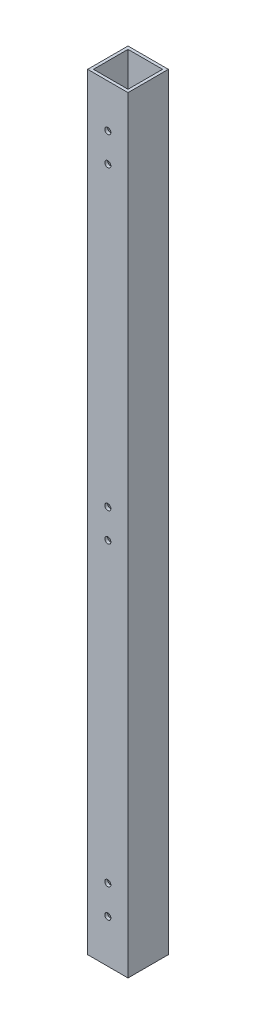
ISO-10303-21;
HEADER;
FILE_DESCRIPTION(('STEP AP214'),'2;1');
FILE_NAME('part.step','',(''),(''),'','','');
FILE_SCHEMA(('AUTOMOTIVE_DESIGN { 1 0 10303 214 1 1 1 1 }'));
ENDSEC;
DATA;
#1=APPLICATION_CONTEXT('core data for automotive mechanical design processes');
#2=APPLICATION_PROTOCOL_DEFINITION('international standard','automotive_design',2000,#1);
#3=PRODUCT_CONTEXT('',#1,'mechanical');
#4=PRODUCT('Part','Part','',(#3));
#5=PRODUCT_RELATED_PRODUCT_CATEGORY('part','',(#4));
#6=PRODUCT_DEFINITION_FORMATION('','',#4);
#7=PRODUCT_DEFINITION_CONTEXT('part definition',#1,'design');
#8=PRODUCT_DEFINITION('design','',#6,#7);
#9=PRODUCT_DEFINITION_SHAPE('','',#8);
#10=(LENGTH_UNIT() NAMED_UNIT(*) SI_UNIT(.MILLI.,.METRE.));
#11=(NAMED_UNIT(*) PLANE_ANGLE_UNIT() SI_UNIT($,.RADIAN.));
#12=(NAMED_UNIT(*) SI_UNIT($,.STERADIAN.) SOLID_ANGLE_UNIT());
#13=UNCERTAINTY_MEASURE_WITH_UNIT(LENGTH_MEASURE(1.E-05),#10,'distance_accuracy_value','');
#14=(GEOMETRIC_REPRESENTATION_CONTEXT(3) GLOBAL_UNCERTAINTY_ASSIGNED_CONTEXT((#13)) GLOBAL_UNIT_ASSIGNED_CONTEXT((#10,
#11,#12)) REPRESENTATION_CONTEXT('',''));
#15=CARTESIAN_POINT('',(0.,0.,0.));
#16=DIRECTION('',(0.,0.,1.));
#17=DIRECTION('',(1.,0.,0.));
#18=AXIS2_PLACEMENT_3D('',#15,#16,#17);
#19=CARTESIAN_POINT('',(0.,844.55,0.));
#20=DIRECTION('',(0.,-1.,0.));
#21=DIRECTION('',(0.,0.,-1.));
#22=AXIS2_PLACEMENT_3D('',#19,#20,#21);
#23=PLANE('',#22);
#24=DIRECTION('',(0.,0.,1.));
#25=VECTOR('',#24,1.);
#26=CARTESIAN_POINT('',(0.,844.55,0.));
#27=LINE('',#26,#25);
#28=CARTESIAN_POINT('',(0.,844.55,-44.45));
#29=VERTEX_POINT('',#28);
#30=CARTESIAN_POINT('',(0.,844.55,0.));
#31=VERTEX_POINT('',#30);
#32=EDGE_CURVE('E139',#29,#31,#27,.T.);
#33=ORIENTED_EDGE('',*,*,#32,.T.);
#34=DIRECTION('',(1.,0.,0.));
#35=VECTOR('',#34,1.);
#36=CARTESIAN_POINT('',(0.,844.55,0.));
#37=LINE('',#36,#35);
#38=CARTESIAN_POINT('',(44.45,844.55,0.));
#39=VERTEX_POINT('',#38);
#40=EDGE_CURVE('E142',#31,#39,#37,.T.);
#41=ORIENTED_EDGE('',*,*,#40,.T.);
#42=DIRECTION('',(0.,0.,-1.));
#43=VECTOR('',#42,1.);
#44=CARTESIAN_POINT('',(44.45,844.55,0.));
#45=LINE('',#44,#43);
#46=CARTESIAN_POINT('',(44.45,844.55,-44.45));
#47=VERTEX_POINT('',#46);
#48=EDGE_CURVE('E145',#39,#47,#45,.T.);
#49=ORIENTED_EDGE('',*,*,#48,.T.);
#50=DIRECTION('',(-1.,0.,0.));
#51=VECTOR('',#50,1.);
#52=CARTESIAN_POINT('',(0.,844.55,-44.45));
#53=LINE('',#52,#51);
#54=EDGE_CURVE('E147',#47,#29,#53,.T.);
#55=ORIENTED_EDGE('',*,*,#54,.T.);
#56=EDGE_LOOP('',(#33,#41,#49,#55));
#57=FACE_BOUND('',#56,.T.);
#58=DIRECTION('',(0.,0.,1.));
#59=VECTOR('',#58,1.);
#60=CARTESIAN_POINT('',(3.175,844.55,-41.275));
#61=LINE('',#60,#59);
#62=CARTESIAN_POINT('',(3.175,844.55,-41.275));
#63=VERTEX_POINT('',#62);
#64=CARTESIAN_POINT('',(3.17500000000001,844.55,-3.175));
#65=VERTEX_POINT('',#64);
#66=EDGE_CURVE('E101',#63,#65,#61,.T.);
#67=ORIENTED_EDGE('',*,*,#66,.F.);
#68=DIRECTION('',(-1.,0.,0.));
#69=VECTOR('',#68,1.);
#70=CARTESIAN_POINT('',(3.175,844.55,-41.275));
#71=LINE('',#70,#69);
#72=CARTESIAN_POINT('',(41.275,844.55,-41.275));
#73=VERTEX_POINT('',#72);
#74=EDGE_CURVE('E123',#73,#63,#71,.T.);
#75=ORIENTED_EDGE('',*,*,#74,.F.);
#76=DIRECTION('',(0.,0.,-1.));
#77=VECTOR('',#76,1.);
#78=CARTESIAN_POINT('',(41.275,844.55,-41.275));
#79=LINE('',#78,#77);
#80=CARTESIAN_POINT('',(41.275,844.55,-3.175));
#81=VERTEX_POINT('',#80);
#82=EDGE_CURVE('E121',#81,#73,#79,.T.);
#83=ORIENTED_EDGE('',*,*,#82,.F.);
#84=DIRECTION('',(1.,0.,0.));
#85=VECTOR('',#84,1.);
#86=CARTESIAN_POINT('',(3.17500000000001,844.55,-3.175));
#87=LINE('',#86,#85);
#88=EDGE_CURVE('E109',#65,#81,#87,.T.);
#89=ORIENTED_EDGE('',*,*,#88,.F.);
#90=EDGE_LOOP('',(#67,#75,#83,#89));
#91=FACE_BOUND('',#90,.T.);
#92=ADVANCED_FACE('F34',(#57,#91),#23,.F.);
#93=CARTESIAN_POINT('',(0.,0.,0.));
#94=DIRECTION('',(0.,-1.,0.));
#95=DIRECTION('',(0.,0.,-1.));
#96=AXIS2_PLACEMENT_3D('',#93,#94,#95);
#97=PLANE('',#96);
#98=DIRECTION('',(0.,0.,1.));
#99=VECTOR('',#98,1.);
#100=CARTESIAN_POINT('',(0.,0.,0.));
#101=LINE('',#100,#99);
#102=CARTESIAN_POINT('',(0.,0.,-44.45));
#103=VERTEX_POINT('',#102);
#104=CARTESIAN_POINT('',(0.,0.,0.));
#105=VERTEX_POINT('',#104);
#106=EDGE_CURVE('E117',#103,#105,#101,.T.);
#107=ORIENTED_EDGE('',*,*,#106,.F.);
#108=DIRECTION('',(-1.,0.,0.));
#109=VECTOR('',#108,1.);
#110=CARTESIAN_POINT('',(0.,0.,-44.45));
#111=LINE('',#110,#109);
#112=CARTESIAN_POINT('',(44.45,0.,-44.45));
#113=VERTEX_POINT('',#112);
#114=EDGE_CURVE('E143',#113,#103,#111,.T.);
#115=ORIENTED_EDGE('',*,*,#114,.F.);
#116=DIRECTION('',(0.,0.,-1.));
#117=VECTOR('',#116,1.);
#118=CARTESIAN_POINT('',(44.45,0.,0.));
#119=LINE('',#118,#117);
#120=CARTESIAN_POINT('',(44.45,0.,0.));
#121=VERTEX_POINT('',#120);
#122=EDGE_CURVE('E154',#121,#113,#119,.T.);
#123=ORIENTED_EDGE('',*,*,#122,.F.);
#124=DIRECTION('',(1.,0.,0.));
#125=VECTOR('',#124,1.);
#126=CARTESIAN_POINT('',(0.,0.,0.));
#127=LINE('',#126,#125);
#128=EDGE_CURVE('E152',#105,#121,#127,.T.);
#129=ORIENTED_EDGE('',*,*,#128,.F.);
#130=EDGE_LOOP('',(#107,#115,#123,#129));
#131=FACE_BOUND('',#130,.T.);
#132=DIRECTION('',(-1.,0.,0.));
#133=VECTOR('',#132,1.);
#134=CARTESIAN_POINT('',(3.175,0.,-41.275));
#135=LINE('',#134,#133);
#136=CARTESIAN_POINT('',(41.275,0.,-41.275));
#137=VERTEX_POINT('',#136);
#138=CARTESIAN_POINT('',(3.175,0.,-41.275));
#139=VERTEX_POINT('',#138);
#140=EDGE_CURVE('E110',#137,#139,#135,.T.);
#141=ORIENTED_EDGE('',*,*,#140,.T.);
#142=DIRECTION('',(0.,0.,1.));
#143=VECTOR('',#142,1.);
#144=CARTESIAN_POINT('',(3.175,0.,-41.275));
#145=LINE('',#144,#143);
#146=CARTESIAN_POINT('',(3.17500000000001,0.,-3.175));
#147=VERTEX_POINT('',#146);
#148=EDGE_CURVE('E59',#139,#147,#145,.T.);
#149=ORIENTED_EDGE('',*,*,#148,.T.);
#150=DIRECTION('',(1.,0.,0.));
#151=VECTOR('',#150,1.);
#152=CARTESIAN_POINT('',(3.17500000000001,0.,-3.175));
#153=LINE('',#152,#151);
#154=CARTESIAN_POINT('',(41.275,0.,-3.175));
#155=VERTEX_POINT('',#154);
#156=EDGE_CURVE('E116',#147,#155,#153,.T.);
#157=ORIENTED_EDGE('',*,*,#156,.T.);
#158=DIRECTION('',(0.,0.,-1.));
#159=VECTOR('',#158,1.);
#160=CARTESIAN_POINT('',(41.275,0.,-41.275));
#161=LINE('',#160,#159);
#162=EDGE_CURVE('E131',#155,#137,#161,.T.);
#163=ORIENTED_EDGE('',*,*,#162,.T.);
#164=EDGE_LOOP('',(#141,#149,#157,#163));
#165=FACE_BOUND('',#164,.T.);
#166=ADVANCED_FACE('F238',(#131,#165),#97,.T.);
#167=CARTESIAN_POINT('',(0.,844.55,0.));
#168=DIRECTION('',(1.,0.,0.));
#169=DIRECTION('',(0.,0.,-1.));
#170=AXIS2_PLACEMENT_3D('',#167,#168,#169);
#171=PLANE('',#170);
#172=ORIENTED_EDGE('',*,*,#106,.T.);
#173=DIRECTION('',(0.,-1.,0.));
#174=VECTOR('',#173,1.);
#175=CARTESIAN_POINT('',(0.,844.55,0.));
#176=LINE('',#175,#174);
#177=EDGE_CURVE('E11',#31,#105,#176,.T.);
#178=ORIENTED_EDGE('',*,*,#177,.F.);
#179=ORIENTED_EDGE('',*,*,#32,.F.);
#180=DIRECTION('',(0.,-1.,0.));
#181=VECTOR('',#180,1.);
#182=CARTESIAN_POINT('',(0.,844.55,-44.45));
#183=LINE('',#182,#181);
#184=EDGE_CURVE('E149',#29,#103,#183,.T.);
#185=ORIENTED_EDGE('',*,*,#184,.T.);
#186=EDGE_LOOP('',(#172,#178,#179,#185));
#187=FACE_BOUND('',#186,.T.);
#188=ADVANCED_FACE('F36',(#187),#171,.F.);
#189=CARTESIAN_POINT('',(0.,844.55,0.));
#190=DIRECTION('',(0.,0.,-1.));
#191=DIRECTION('',(-1.,0.,0.));
#192=AXIS2_PLACEMENT_3D('',#189,#190,#191);
#193=PLANE('',#192);
#194=CARTESIAN_POINT('',(22.225,796.925,0.));
#195=DIRECTION('',(0.,0.,1.));
#196=DIRECTION('',(1.,0.,0.));
#197=AXIS2_PLACEMENT_3D('',#194,#195,#196);
#198=CIRCLE('',#197,3.37350099999999);
#199=CARTESIAN_POINT('',(25.598501,796.925,0.));
#200=VERTEX_POINT('',#199);
#201=EDGE_CURVE('E274',#200,#200,#198,.T.);
#202=ORIENTED_EDGE('',*,*,#201,.F.);
#203=EDGE_LOOP('',(#202));
#204=FACE_BOUND('',#203,.T.);
#205=CARTESIAN_POINT('',(22.225,765.175,0.));
#206=DIRECTION('',(0.,0.,1.));
#207=DIRECTION('',(1.,0.,0.));
#208=AXIS2_PLACEMENT_3D('',#205,#206,#207);
#209=CIRCLE('',#208,3.37350099999999);
#210=CARTESIAN_POINT('',(25.598501,765.175,0.));
#211=VERTEX_POINT('',#210);
#212=EDGE_CURVE('E188',#211,#211,#209,.T.);
#213=ORIENTED_EDGE('',*,*,#212,.F.);
#214=EDGE_LOOP('',(#213));
#215=FACE_BOUND('',#214,.T.);
#216=CARTESIAN_POINT('',(22.225,438.15,0.));
#217=DIRECTION('',(0.,0.,1.));
#218=DIRECTION('',(1.,0.,0.));
#219=AXIS2_PLACEMENT_3D('',#216,#217,#218);
#220=CIRCLE('',#219,3.37350099999999);
#221=CARTESIAN_POINT('',(25.598501,438.15,0.));
#222=VERTEX_POINT('',#221);
#223=EDGE_CURVE('E185',#222,#222,#220,.T.);
#224=ORIENTED_EDGE('',*,*,#223,.F.);
#225=EDGE_LOOP('',(#224));
#226=FACE_BOUND('',#225,.T.);
#227=CARTESIAN_POINT('',(22.225,406.4,0.));
#228=DIRECTION('',(0.,0.,1.));
#229=DIRECTION('',(1.,0.,0.));
#230=AXIS2_PLACEMENT_3D('',#227,#228,#229);
#231=CIRCLE('',#230,3.37350099999999);
#232=CARTESIAN_POINT('',(25.598501,406.4,0.));
#233=VERTEX_POINT('',#232);
#234=EDGE_CURVE('E203',#233,#233,#231,.T.);
#235=ORIENTED_EDGE('',*,*,#234,.F.);
#236=EDGE_LOOP('',(#235));
#237=FACE_BOUND('',#236,.T.);
#238=CARTESIAN_POINT('',(22.225,79.3750000000001,0.));
#239=DIRECTION('',(0.,0.,1.));
#240=DIRECTION('',(1.,0.,0.));
#241=AXIS2_PLACEMENT_3D('',#238,#239,#240);
#242=CIRCLE('',#241,3.37350099999999);
#243=CARTESIAN_POINT('',(25.598501,79.3750000000001,0.));
#244=VERTEX_POINT('',#243);
#245=EDGE_CURVE('E210',#244,#244,#242,.T.);
#246=ORIENTED_EDGE('',*,*,#245,.F.);
#247=EDGE_LOOP('',(#246));
#248=FACE_BOUND('',#247,.T.);
#249=CARTESIAN_POINT('',(22.225,47.625,0.));
#250=DIRECTION('',(0.,0.,1.));
#251=DIRECTION('',(1.,0.,0.));
#252=AXIS2_PLACEMENT_3D('',#249,#250,#251);
#253=CIRCLE('',#252,3.37350099999999);
#254=CARTESIAN_POINT('',(25.598501,47.625,0.));
#255=VERTEX_POINT('',#254);
#256=EDGE_CURVE('E217',#255,#255,#253,.T.);
#257=ORIENTED_EDGE('',*,*,#256,.F.);
#258=EDGE_LOOP('',(#257));
#259=FACE_BOUND('',#258,.T.);
#260=ORIENTED_EDGE('',*,*,#128,.T.);
#261=DIRECTION('',(0.,-1.,0.));
#262=VECTOR('',#261,1.);
#263=CARTESIAN_POINT('',(44.45,844.55,0.));
#264=LINE('',#263,#262);
#265=EDGE_CURVE('E43',#39,#121,#264,.T.);
#266=ORIENTED_EDGE('',*,*,#265,.F.);
#267=ORIENTED_EDGE('',*,*,#40,.F.);
#268=ORIENTED_EDGE('',*,*,#177,.T.);
#269=EDGE_LOOP('',(#260,#266,#267,#268));
#270=FACE_BOUND('',#269,.T.);
#271=ADVANCED_FACE('F263',(#204,#215,#226,#237,#248,#259,#270),#193,.F.);
#272=CARTESIAN_POINT('',(44.45,844.55,0.));
#273=DIRECTION('',(-1.,0.,0.));
#274=DIRECTION('',(0.,0.,1.));
#275=AXIS2_PLACEMENT_3D('',#272,#273,#274);
#276=PLANE('',#275);
#277=ORIENTED_EDGE('',*,*,#122,.T.);
#278=DIRECTION('',(0.,-1.,0.));
#279=VECTOR('',#278,1.);
#280=CARTESIAN_POINT('',(44.45,844.55,-44.45));
#281=LINE('',#280,#279);
#282=EDGE_CURVE('E159',#47,#113,#281,.T.);
#283=ORIENTED_EDGE('',*,*,#282,.F.);
#284=ORIENTED_EDGE('',*,*,#48,.F.);
#285=ORIENTED_EDGE('',*,*,#265,.T.);
#286=EDGE_LOOP('',(#277,#283,#284,#285));
#287=FACE_BOUND('',#286,.T.);
#288=ADVANCED_FACE('F260',(#287),#276,.F.);
#289=CARTESIAN_POINT('',(0.,844.55,-44.45));
#290=DIRECTION('',(0.,0.,1.));
#291=DIRECTION('',(1.,0.,0.));
#292=AXIS2_PLACEMENT_3D('',#289,#290,#291);
#293=PLANE('',#292);
#294=CARTESIAN_POINT('',(22.225,796.925,-44.45));
#295=DIRECTION('',(0.,0.,1.));
#296=DIRECTION('',(1.,0.,0.));
#297=AXIS2_PLACEMENT_3D('',#294,#295,#296);
#298=CIRCLE('',#297,3.37350099999999);
#299=CARTESIAN_POINT('',(25.598501,796.925,-44.45));
#300=VERTEX_POINT('',#299);
#301=EDGE_CURVE('E339',#300,#300,#298,.T.);
#302=ORIENTED_EDGE('',*,*,#301,.T.);
#303=EDGE_LOOP('',(#302));
#304=FACE_BOUND('',#303,.T.);
#305=CARTESIAN_POINT('',(22.225,765.175,-44.45));
#306=DIRECTION('',(0.,0.,1.));
#307=DIRECTION('',(1.,0.,0.));
#308=AXIS2_PLACEMENT_3D('',#305,#306,#307);
#309=CIRCLE('',#308,3.37350099999999);
#310=CARTESIAN_POINT('',(25.598501,765.175,-44.45));
#311=VERTEX_POINT('',#310);
#312=EDGE_CURVE('E181',#311,#311,#309,.T.);
#313=ORIENTED_EDGE('',*,*,#312,.T.);
#314=EDGE_LOOP('',(#313));
#315=FACE_BOUND('',#314,.T.);
#316=CARTESIAN_POINT('',(22.225,438.15,-44.45));
#317=DIRECTION('',(0.,0.,1.));
#318=DIRECTION('',(1.,0.,0.));
#319=AXIS2_PLACEMENT_3D('',#316,#317,#318);
#320=CIRCLE('',#319,3.37350099999999);
#321=CARTESIAN_POINT('',(25.598501,438.15,-44.45));
#322=VERTEX_POINT('',#321);
#323=EDGE_CURVE('E177',#322,#322,#320,.T.);
#324=ORIENTED_EDGE('',*,*,#323,.T.);
#325=EDGE_LOOP('',(#324));
#326=FACE_BOUND('',#325,.T.);
#327=CARTESIAN_POINT('',(22.225,406.4,-44.45));
#328=DIRECTION('',(0.,0.,1.));
#329=DIRECTION('',(1.,0.,0.));
#330=AXIS2_PLACEMENT_3D('',#327,#328,#329);
#331=CIRCLE('',#330,3.37350099999999);
#332=CARTESIAN_POINT('',(25.598501,406.4,-44.45));
#333=VERTEX_POINT('',#332);
#334=EDGE_CURVE('E173',#333,#333,#331,.T.);
#335=ORIENTED_EDGE('',*,*,#334,.T.);
#336=EDGE_LOOP('',(#335));
#337=FACE_BOUND('',#336,.T.);
#338=CARTESIAN_POINT('',(22.225,79.3750000000001,-44.45));
#339=DIRECTION('',(0.,0.,1.));
#340=DIRECTION('',(1.,0.,0.));
#341=AXIS2_PLACEMENT_3D('',#338,#339,#340);
#342=CIRCLE('',#341,3.37350099999999);
#343=CARTESIAN_POINT('',(25.598501,79.3750000000001,-44.45));
#344=VERTEX_POINT('',#343);
#345=EDGE_CURVE('E168',#344,#344,#342,.T.);
#346=ORIENTED_EDGE('',*,*,#345,.T.);
#347=EDGE_LOOP('',(#346));
#348=FACE_BOUND('',#347,.T.);
#349=CARTESIAN_POINT('',(22.225,47.625,-44.45));
#350=DIRECTION('',(0.,0.,1.));
#351=DIRECTION('',(1.,0.,0.));
#352=AXIS2_PLACEMENT_3D('',#349,#350,#351);
#353=CIRCLE('',#352,3.37350099999999);
#354=CARTESIAN_POINT('',(25.598501,47.625,-44.45));
#355=VERTEX_POINT('',#354);
#356=EDGE_CURVE('E220',#355,#355,#353,.T.);
#357=ORIENTED_EDGE('',*,*,#356,.T.);
#358=EDGE_LOOP('',(#357));
#359=FACE_BOUND('',#358,.T.);
#360=ORIENTED_EDGE('',*,*,#114,.T.);
#361=ORIENTED_EDGE('',*,*,#184,.F.);
#362=ORIENTED_EDGE('',*,*,#54,.F.);
#363=ORIENTED_EDGE('',*,*,#282,.T.);
#364=EDGE_LOOP('',(#360,#361,#362,#363));
#365=FACE_BOUND('',#364,.T.);
#366=ADVANCED_FACE('F257',(#304,#315,#326,#337,#348,#359,#365),#293,.F.);
#367=CARTESIAN_POINT('',(3.175,844.55,-41.275));
#368=DIRECTION('',(1.,0.,0.));
#369=DIRECTION('',(0.,0.,-1.));
#370=AXIS2_PLACEMENT_3D('',#367,#368,#369);
#371=PLANE('',#370);
#372=ORIENTED_EDGE('',*,*,#148,.F.);
#373=DIRECTION('',(0.,-1.,0.));
#374=VECTOR('',#373,1.);
#375=CARTESIAN_POINT('',(3.175,844.55,-41.275));
#376=LINE('',#375,#374);
#377=EDGE_CURVE('E105',#63,#139,#376,.T.);
#378=ORIENTED_EDGE('',*,*,#377,.F.);
#379=ORIENTED_EDGE('',*,*,#66,.T.);
#380=DIRECTION('',(0.,-1.,0.));
#381=VECTOR('',#380,1.);
#382=CARTESIAN_POINT('',(3.17500000000001,844.55,-3.175));
#383=LINE('',#382,#381);
#384=EDGE_CURVE('E104',#65,#147,#383,.T.);
#385=ORIENTED_EDGE('',*,*,#384,.T.);
#386=EDGE_LOOP('',(#372,#378,#379,#385));
#387=FACE_BOUND('',#386,.T.);
#388=ADVANCED_FACE('F103',(#387),#371,.T.);
#389=CARTESIAN_POINT('',(3.17500000000001,844.55,-3.175));
#390=DIRECTION('',(0.,0.,-1.));
#391=DIRECTION('',(-1.,0.,0.));
#392=AXIS2_PLACEMENT_3D('',#389,#390,#391);
#393=PLANE('',#392);
#394=CARTESIAN_POINT('',(22.225,796.925,-3.175));
#395=DIRECTION('',(0.,0.,-1.));
#396=DIRECTION('',(-1.,0.,0.));
#397=AXIS2_PLACEMENT_3D('',#394,#395,#396);
#398=CIRCLE('',#397,3.37350099999999);
#399=CARTESIAN_POINT('',(18.851499,796.925,-3.175));
#400=VERTEX_POINT('',#399);
#401=EDGE_CURVE('E193',#400,#400,#398,.T.);
#402=ORIENTED_EDGE('',*,*,#401,.F.);
#403=EDGE_LOOP('',(#402));
#404=FACE_BOUND('',#403,.T.);
#405=CARTESIAN_POINT('',(22.225,765.175,-3.175));
#406=DIRECTION('',(0.,0.,-1.));
#407=DIRECTION('',(-1.,0.,0.));
#408=AXIS2_PLACEMENT_3D('',#405,#406,#407);
#409=CIRCLE('',#408,3.37350099999999);
#410=CARTESIAN_POINT('',(18.851499,765.175,-3.175));
#411=VERTEX_POINT('',#410);
#412=EDGE_CURVE('E180',#411,#411,#409,.T.);
#413=ORIENTED_EDGE('',*,*,#412,.F.);
#414=EDGE_LOOP('',(#413));
#415=FACE_BOUND('',#414,.T.);
#416=CARTESIAN_POINT('',(22.225,438.15,-3.175));
#417=DIRECTION('',(0.,0.,-1.));
#418=DIRECTION('',(-1.,0.,0.));
#419=AXIS2_PLACEMENT_3D('',#416,#417,#418);
#420=CIRCLE('',#419,3.37350099999999);
#421=CARTESIAN_POINT('',(18.851499,438.15,-3.175));
#422=VERTEX_POINT('',#421);
#423=EDGE_CURVE('E174',#422,#422,#420,.T.);
#424=ORIENTED_EDGE('',*,*,#423,.F.);
#425=EDGE_LOOP('',(#424));
#426=FACE_BOUND('',#425,.T.);
#427=CARTESIAN_POINT('',(22.225,406.4,-3.175));
#428=DIRECTION('',(0.,0.,-1.));
#429=DIRECTION('',(-1.,0.,0.));
#430=AXIS2_PLACEMENT_3D('',#427,#428,#429);
#431=CIRCLE('',#430,3.37350099999999);
#432=CARTESIAN_POINT('',(18.851499,406.4,-3.175));
#433=VERTEX_POINT('',#432);
#434=EDGE_CURVE('E169',#433,#433,#431,.T.);
#435=ORIENTED_EDGE('',*,*,#434,.F.);
#436=EDGE_LOOP('',(#435));
#437=FACE_BOUND('',#436,.T.);
#438=CARTESIAN_POINT('',(22.225,79.3750000000001,-3.175));
#439=DIRECTION('',(0.,0.,-1.));
#440=DIRECTION('',(-1.,0.,0.));
#441=AXIS2_PLACEMENT_3D('',#438,#439,#440);
#442=CIRCLE('',#441,3.37350099999999);
#443=CARTESIAN_POINT('',(18.851499,79.3750000000001,-3.175));
#444=VERTEX_POINT('',#443);
#445=EDGE_CURVE('E164',#444,#444,#442,.T.);
#446=ORIENTED_EDGE('',*,*,#445,.F.);
#447=EDGE_LOOP('',(#446));
#448=FACE_BOUND('',#447,.T.);
#449=CARTESIAN_POINT('',(22.225,47.625,-3.175));
#450=DIRECTION('',(0.,0.,-1.));
#451=DIRECTION('',(-1.,0.,0.));
#452=AXIS2_PLACEMENT_3D('',#449,#450,#451);
#453=CIRCLE('',#452,3.37350099999999);
#454=CARTESIAN_POINT('',(18.851499,47.625,-3.175));
#455=VERTEX_POINT('',#454);
#456=EDGE_CURVE('E223',#455,#455,#453,.T.);
#457=ORIENTED_EDGE('',*,*,#456,.F.);
#458=EDGE_LOOP('',(#457));
#459=FACE_BOUND('',#458,.T.);
#460=ORIENTED_EDGE('',*,*,#156,.F.);
#461=ORIENTED_EDGE('',*,*,#384,.F.);
#462=ORIENTED_EDGE('',*,*,#88,.T.);
#463=DIRECTION('',(0.,-1.,0.));
#464=VECTOR('',#463,1.);
#465=CARTESIAN_POINT('',(41.275,844.55,-3.175));
#466=LINE('',#465,#464);
#467=EDGE_CURVE('E118',#81,#155,#466,.T.);
#468=ORIENTED_EDGE('',*,*,#467,.T.);
#469=EDGE_LOOP('',(#460,#461,#462,#468));
#470=FACE_BOUND('',#469,.T.);
#471=ADVANCED_FACE('F113',(#404,#415,#426,#437,#448,#459,#470),#393,.T.);
#472=CARTESIAN_POINT('',(41.275,844.55,-41.275));
#473=DIRECTION('',(-1.,0.,0.));
#474=DIRECTION('',(0.,0.,1.));
#475=AXIS2_PLACEMENT_3D('',#472,#473,#474);
#476=PLANE('',#475);
#477=ORIENTED_EDGE('',*,*,#162,.F.);
#478=ORIENTED_EDGE('',*,*,#467,.F.);
#479=ORIENTED_EDGE('',*,*,#82,.T.);
#480=DIRECTION('',(0.,-1.,0.));
#481=VECTOR('',#480,1.);
#482=CARTESIAN_POINT('',(41.275,844.55,-41.275));
#483=LINE('',#482,#481);
#484=EDGE_CURVE('E51',#73,#137,#483,.T.);
#485=ORIENTED_EDGE('',*,*,#484,.T.);
#486=EDGE_LOOP('',(#477,#478,#479,#485));
#487=FACE_BOUND('',#486,.T.);
#488=ADVANCED_FACE('F233',(#487),#476,.T.);
#489=CARTESIAN_POINT('',(3.175,844.55,-41.275));
#490=DIRECTION('',(0.,0.,1.));
#491=DIRECTION('',(1.,0.,0.));
#492=AXIS2_PLACEMENT_3D('',#489,#490,#491);
#493=PLANE('',#492);
#494=CARTESIAN_POINT('',(22.225,796.925,-41.275));
#495=DIRECTION('',(0.,0.,1.));
#496=DIRECTION('',(1.,0.,0.));
#497=AXIS2_PLACEMENT_3D('',#494,#495,#496);
#498=CIRCLE('',#497,3.37350099999999);
#499=CARTESIAN_POINT('',(25.598501,796.925,-41.275));
#500=VERTEX_POINT('',#499);
#501=EDGE_CURVE('E38',#500,#500,#498,.T.);
#502=ORIENTED_EDGE('',*,*,#501,.F.);
#503=EDGE_LOOP('',(#502));
#504=FACE_BOUND('',#503,.T.);
#505=CARTESIAN_POINT('',(22.225,765.175,-41.275));
#506=DIRECTION('',(0.,0.,1.));
#507=DIRECTION('',(1.,0.,0.));
#508=AXIS2_PLACEMENT_3D('',#505,#506,#507);
#509=CIRCLE('',#508,3.37350099999999);
#510=CARTESIAN_POINT('',(25.598501,765.175,-41.275));
#511=VERTEX_POINT('',#510);
#512=EDGE_CURVE('E178',#511,#511,#509,.T.);
#513=ORIENTED_EDGE('',*,*,#512,.F.);
#514=EDGE_LOOP('',(#513));
#515=FACE_BOUND('',#514,.T.);
#516=CARTESIAN_POINT('',(22.225,438.15,-41.275));
#517=DIRECTION('',(0.,0.,1.));
#518=DIRECTION('',(1.,0.,0.));
#519=AXIS2_PLACEMENT_3D('',#516,#517,#518);
#520=CIRCLE('',#519,3.37350099999999);
#521=CARTESIAN_POINT('',(25.598501,438.15,-41.275));
#522=VERTEX_POINT('',#521);
#523=EDGE_CURVE('E176',#522,#522,#520,.T.);
#524=ORIENTED_EDGE('',*,*,#523,.F.);
#525=EDGE_LOOP('',(#524));
#526=FACE_BOUND('',#525,.T.);
#527=CARTESIAN_POINT('',(22.225,406.4,-41.275));
#528=DIRECTION('',(0.,0.,1.));
#529=DIRECTION('',(1.,0.,0.));
#530=AXIS2_PLACEMENT_3D('',#527,#528,#529);
#531=CIRCLE('',#530,3.37350099999999);
#532=CARTESIAN_POINT('',(25.598501,406.4,-41.275));
#533=VERTEX_POINT('',#532);
#534=EDGE_CURVE('E172',#533,#533,#531,.T.);
#535=ORIENTED_EDGE('',*,*,#534,.F.);
#536=EDGE_LOOP('',(#535));
#537=FACE_BOUND('',#536,.T.);
#538=CARTESIAN_POINT('',(22.225,79.3750000000001,-41.275));
#539=DIRECTION('',(0.,0.,1.));
#540=DIRECTION('',(1.,0.,0.));
#541=AXIS2_PLACEMENT_3D('',#538,#539,#540);
#542=CIRCLE('',#541,3.37350099999999);
#543=CARTESIAN_POINT('',(25.598501,79.3750000000001,-41.275));
#544=VERTEX_POINT('',#543);
#545=EDGE_CURVE('E167',#544,#544,#542,.T.);
#546=ORIENTED_EDGE('',*,*,#545,.F.);
#547=EDGE_LOOP('',(#546));
#548=FACE_BOUND('',#547,.T.);
#549=CARTESIAN_POINT('',(22.225,47.625,-41.275));
#550=DIRECTION('',(0.,0.,1.));
#551=DIRECTION('',(1.,0.,0.));
#552=AXIS2_PLACEMENT_3D('',#549,#550,#551);
#553=CIRCLE('',#552,3.37350099999999);
#554=CARTESIAN_POINT('',(25.598501,47.625,-41.275));
#555=VERTEX_POINT('',#554);
#556=EDGE_CURVE('E129',#555,#555,#553,.T.);
#557=ORIENTED_EDGE('',*,*,#556,.F.);
#558=EDGE_LOOP('',(#557));
#559=FACE_BOUND('',#558,.T.);
#560=ORIENTED_EDGE('',*,*,#140,.F.);
#561=ORIENTED_EDGE('',*,*,#484,.F.);
#562=ORIENTED_EDGE('',*,*,#74,.T.);
#563=ORIENTED_EDGE('',*,*,#377,.T.);
#564=EDGE_LOOP('',(#560,#561,#562,#563));
#565=FACE_BOUND('',#564,.T.);
#566=ADVANCED_FACE('F231',(#504,#515,#526,#537,#548,#559,#565),#493,.T.);
#567=CARTESIAN_POINT('',(22.225,47.625,0.));
#568=DIRECTION('',(0.,0.,1.));
#569=DIRECTION('',(1.,0.,0.));
#570=AXIS2_PLACEMENT_3D('',#567,#568,#569);
#571=CYLINDRICAL_SURFACE('',#570,3.37350099999999);
#572=ORIENTED_EDGE('',*,*,#556,.T.);
#573=EDGE_LOOP('',(#572));
#574=FACE_BOUND('',#573,.T.);
#575=ORIENTED_EDGE('',*,*,#356,.F.);
#576=EDGE_LOOP('',(#575));
#577=FACE_BOUND('',#576,.T.);
#578=ADVANCED_FACE('F228',(#574,#577),#571,.F.);
#579=ORIENTED_EDGE('',*,*,#456,.T.);
#580=EDGE_LOOP('',(#579));
#581=FACE_BOUND('',#580,.T.);
#582=ORIENTED_EDGE('',*,*,#256,.T.);
#583=EDGE_LOOP('',(#582));
#584=FACE_BOUND('',#583,.T.);
#585=ADVANCED_FACE('F297',(#581,#584),#571,.F.);
#586=CARTESIAN_POINT('',(22.225,79.3750000000001,0.));
#587=DIRECTION('',(0.,0.,1.));
#588=DIRECTION('',(1.,0.,0.));
#589=AXIS2_PLACEMENT_3D('',#586,#587,#588);
#590=CYLINDRICAL_SURFACE('',#589,3.37350099999999);
#591=ORIENTED_EDGE('',*,*,#445,.T.);
#592=EDGE_LOOP('',(#591));
#593=FACE_BOUND('',#592,.T.);
#594=ORIENTED_EDGE('',*,*,#245,.T.);
#595=EDGE_LOOP('',(#594));
#596=FACE_BOUND('',#595,.T.);
#597=ADVANCED_FACE('F299',(#593,#596),#590,.F.);
#598=ORIENTED_EDGE('',*,*,#545,.T.);
#599=EDGE_LOOP('',(#598));
#600=FACE_BOUND('',#599,.T.);
#601=ORIENTED_EDGE('',*,*,#345,.F.);
#602=EDGE_LOOP('',(#601));
#603=FACE_BOUND('',#602,.T.);
#604=ADVANCED_FACE('F306',(#600,#603),#590,.F.);
#605=CARTESIAN_POINT('',(22.225,406.4,0.));
#606=DIRECTION('',(0.,0.,1.));
#607=DIRECTION('',(1.,0.,0.));
#608=AXIS2_PLACEMENT_3D('',#605,#606,#607);
#609=CYLINDRICAL_SURFACE('',#608,3.37350099999999);
#610=ORIENTED_EDGE('',*,*,#434,.T.);
#611=EDGE_LOOP('',(#610));
#612=FACE_BOUND('',#611,.T.);
#613=ORIENTED_EDGE('',*,*,#234,.T.);
#614=EDGE_LOOP('',(#613));
#615=FACE_BOUND('',#614,.T.);
#616=ADVANCED_FACE('F310',(#612,#615),#609,.F.);
#617=ORIENTED_EDGE('',*,*,#534,.T.);
#618=EDGE_LOOP('',(#617));
#619=FACE_BOUND('',#618,.T.);
#620=ORIENTED_EDGE('',*,*,#334,.F.);
#621=EDGE_LOOP('',(#620));
#622=FACE_BOUND('',#621,.T.);
#623=ADVANCED_FACE('F313',(#619,#622),#609,.F.);
#624=CARTESIAN_POINT('',(22.225,438.15,0.));
#625=DIRECTION('',(0.,0.,1.));
#626=DIRECTION('',(1.,0.,0.));
#627=AXIS2_PLACEMENT_3D('',#624,#625,#626);
#628=CYLINDRICAL_SURFACE('',#627,3.37350099999999);
#629=ORIENTED_EDGE('',*,*,#423,.T.);
#630=EDGE_LOOP('',(#629));
#631=FACE_BOUND('',#630,.T.);
#632=ORIENTED_EDGE('',*,*,#223,.T.);
#633=EDGE_LOOP('',(#632));
#634=FACE_BOUND('',#633,.T.);
#635=ADVANCED_FACE('F315',(#631,#634),#628,.F.);
#636=ORIENTED_EDGE('',*,*,#523,.T.);
#637=EDGE_LOOP('',(#636));
#638=FACE_BOUND('',#637,.T.);
#639=ORIENTED_EDGE('',*,*,#323,.F.);
#640=EDGE_LOOP('',(#639));
#641=FACE_BOUND('',#640,.T.);
#642=ADVANCED_FACE('F318',(#638,#641),#628,.F.);
#643=CARTESIAN_POINT('',(22.225,765.175,0.));
#644=DIRECTION('',(0.,0.,1.));
#645=DIRECTION('',(1.,0.,0.));
#646=AXIS2_PLACEMENT_3D('',#643,#644,#645);
#647=CYLINDRICAL_SURFACE('',#646,3.37350099999999);
#648=ORIENTED_EDGE('',*,*,#512,.T.);
#649=EDGE_LOOP('',(#648));
#650=FACE_BOUND('',#649,.T.);
#651=ORIENTED_EDGE('',*,*,#312,.F.);
#652=EDGE_LOOP('',(#651));
#653=FACE_BOUND('',#652,.T.);
#654=ADVANCED_FACE('F320',(#650,#653),#647,.F.);
#655=ORIENTED_EDGE('',*,*,#412,.T.);
#656=EDGE_LOOP('',(#655));
#657=FACE_BOUND('',#656,.T.);
#658=ORIENTED_EDGE('',*,*,#212,.T.);
#659=EDGE_LOOP('',(#658));
#660=FACE_BOUND('',#659,.T.);
#661=ADVANCED_FACE('F323',(#657,#660),#647,.F.);
#662=CARTESIAN_POINT('',(22.225,796.925,0.));
#663=DIRECTION('',(0.,0.,1.));
#664=DIRECTION('',(1.,0.,0.));
#665=AXIS2_PLACEMENT_3D('',#662,#663,#664);
#666=CYLINDRICAL_SURFACE('',#665,3.37350099999999);
#667=ORIENTED_EDGE('',*,*,#501,.T.);
#668=EDGE_LOOP('',(#667));
#669=FACE_BOUND('',#668,.T.);
#670=ORIENTED_EDGE('',*,*,#301,.F.);
#671=EDGE_LOOP('',(#670));
#672=FACE_BOUND('',#671,.T.);
#673=ADVANCED_FACE('F324',(#669,#672),#666,.F.);
#674=ORIENTED_EDGE('',*,*,#401,.T.);
#675=EDGE_LOOP('',(#674));
#676=FACE_BOUND('',#675,.T.);
#677=ORIENTED_EDGE('',*,*,#201,.T.);
#678=EDGE_LOOP('',(#677));
#679=FACE_BOUND('',#678,.T.);
#680=ADVANCED_FACE('F326',(#676,#679),#666,.F.);
#681=CLOSED_SHELL('',(#92,#166,#188,#271,#288,#366,#388,#471,#488,#566,#578,#585,#597,#604,#616,
#623,#635,#642,#654,#661,#673,#680));
#682=MANIFOLD_SOLID_BREP('B2',#681);
#683=ADVANCED_BREP_SHAPE_REPRESENTATION('',(#18,#682),#14);
#684=SHAPE_DEFINITION_REPRESENTATION(#9,#683);
ENDSEC;
END-ISO-10303-21;
